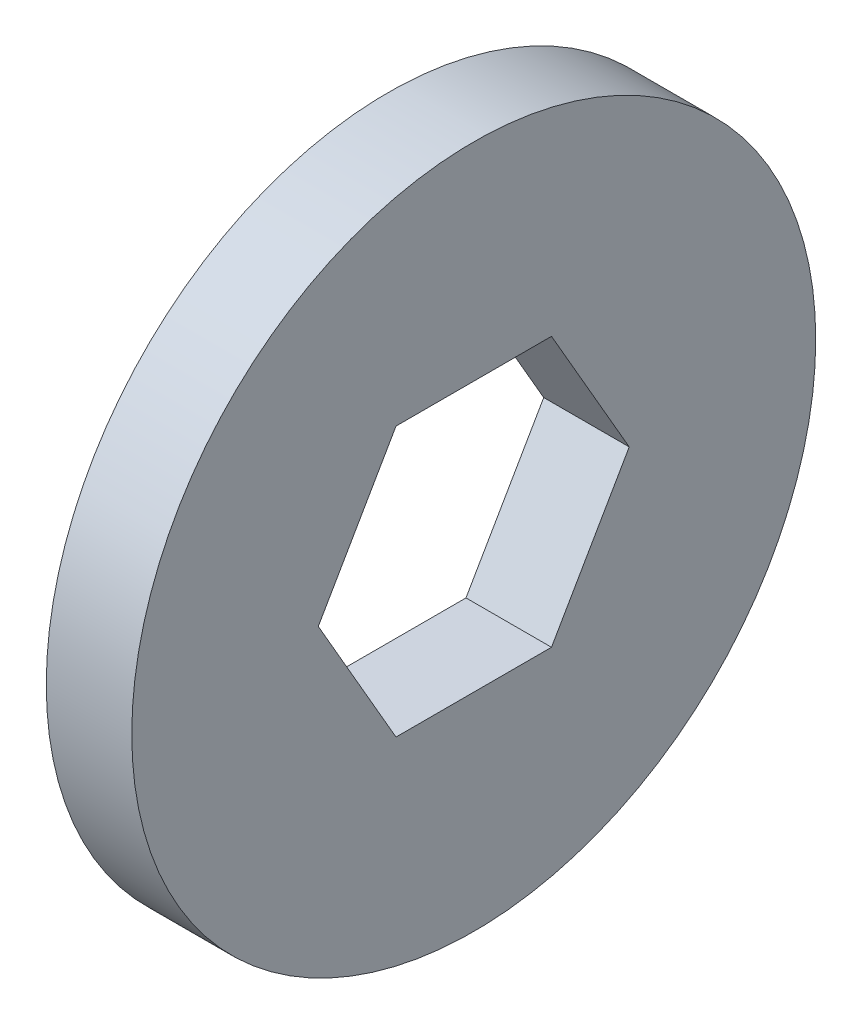
ISO-10303-21;
HEADER;
FILE_DESCRIPTION(('STEP AP214'),'2;1');
FILE_NAME('part.step','',(''),(''),'','','');
FILE_SCHEMA(('AUTOMOTIVE_DESIGN { 1 0 10303 214 1 1 1 1 }'));
ENDSEC;
DATA;
#1=APPLICATION_CONTEXT('core data for automotive mechanical design processes');
#2=APPLICATION_PROTOCOL_DEFINITION('international standard','automotive_design',2000,#1);
#3=PRODUCT_CONTEXT('',#1,'mechanical');
#4=PRODUCT('Part','Part','',(#3));
#5=PRODUCT_RELATED_PRODUCT_CATEGORY('part','',(#4));
#6=PRODUCT_DEFINITION_FORMATION('','',#4);
#7=PRODUCT_DEFINITION_CONTEXT('part definition',#1,'design');
#8=PRODUCT_DEFINITION('design','',#6,#7);
#9=PRODUCT_DEFINITION_SHAPE('','',#8);
#10=(LENGTH_UNIT() NAMED_UNIT(*) SI_UNIT(.MILLI.,.METRE.));
#11=(NAMED_UNIT(*) PLANE_ANGLE_UNIT() SI_UNIT($,.RADIAN.));
#12=(NAMED_UNIT(*) SI_UNIT($,.STERADIAN.) SOLID_ANGLE_UNIT());
#13=UNCERTAINTY_MEASURE_WITH_UNIT(LENGTH_MEASURE(1.E-05),#10,'distance_accuracy_value','');
#14=(GEOMETRIC_REPRESENTATION_CONTEXT(3) GLOBAL_UNCERTAINTY_ASSIGNED_CONTEXT((#13)) GLOBAL_UNIT_ASSIGNED_CONTEXT((#10,
#11,#12)) REPRESENTATION_CONTEXT('',''));
#15=CARTESIAN_POINT('',(0.,0.,0.));
#16=DIRECTION('',(0.,0.,1.));
#17=DIRECTION('',(1.,0.,0.));
#18=AXIS2_PLACEMENT_3D('',#15,#16,#17);
#19=CARTESIAN_POINT('',(1.5875,0.,0.));
#20=DIRECTION('',(1.,0.,0.));
#21=DIRECTION('',(0.,0.,-1.));
#22=AXIS2_PLACEMENT_3D('',#19,#20,#21);
#23=PLANE('',#22);
#24=CARTESIAN_POINT('',(1.5875,0.,0.));
#25=DIRECTION('',(1.,0.,0.));
#26=DIRECTION('',(0.,0.,-1.));
#27=AXIS2_PLACEMENT_3D('',#24,#25,#26);
#28=CIRCLE('',#27,6.35);
#29=CARTESIAN_POINT('',(1.5875,0.,-6.35));
#30=VERTEX_POINT('',#29);
#31=EDGE_CURVE('E11',#30,#30,#28,.T.);
#32=ORIENTED_EDGE('',*,*,#31,.T.);
#33=EDGE_LOOP('',(#32));
#34=FACE_BOUND('',#33,.T.);
#35=DIRECTION('',(0.,0.866025403784438,0.5));
#36=VECTOR('',#35,1.);
#37=CARTESIAN_POINT('',(1.5875,0.,-2.88675134594813));
#38=LINE('',#37,#36);
#39=CARTESIAN_POINT('',(1.5875,0.,-2.88675134594813));
#40=VERTEX_POINT('',#39);
#41=CARTESIAN_POINT('',(1.5875,2.5,-1.44337567297406));
#42=VERTEX_POINT('',#41);
#43=EDGE_CURVE('E128',#40,#42,#38,.T.);
#44=ORIENTED_EDGE('',*,*,#43,.F.);
#45=DIRECTION('',(0.,0.866025403784439,-0.5));
#46=VECTOR('',#45,1.);
#47=CARTESIAN_POINT('',(1.5875,-2.5,-1.44337567297407));
#48=LINE('',#47,#46);
#49=CARTESIAN_POINT('',(1.5875,-2.5,-1.44337567297407));
#50=VERTEX_POINT('',#49);
#51=EDGE_CURVE('E119',#50,#40,#48,.T.);
#52=ORIENTED_EDGE('',*,*,#51,.F.);
#53=DIRECTION('',(0.,0.,-1.));
#54=VECTOR('',#53,1.);
#55=CARTESIAN_POINT('',(1.5875,-2.5,1.44337567297406));
#56=LINE('',#55,#54);
#57=CARTESIAN_POINT('',(1.5875,-2.5,1.44337567297406));
#58=VERTEX_POINT('',#57);
#59=EDGE_CURVE('E154',#58,#50,#56,.T.);
#60=ORIENTED_EDGE('',*,*,#59,.F.);
#61=DIRECTION('',(0.,-0.866025403784438,-0.5));
#62=VECTOR('',#61,1.);
#63=CARTESIAN_POINT('',(1.5875,0.,2.88675134594813));
#64=LINE('',#63,#62);
#65=CARTESIAN_POINT('',(1.5875,0.,2.88675134594813));
#66=VERTEX_POINT('',#65);
#67=EDGE_CURVE('E151',#66,#58,#64,.T.);
#68=ORIENTED_EDGE('',*,*,#67,.F.);
#69=DIRECTION('',(0.,-0.866025403784439,0.5));
#70=VECTOR('',#69,1.);
#71=CARTESIAN_POINT('',(1.5875,2.5,1.44337567297406));
#72=LINE('',#71,#70);
#73=CARTESIAN_POINT('',(1.5875,2.5,1.44337567297406));
#74=VERTEX_POINT('',#73);
#75=EDGE_CURVE('E146',#74,#66,#72,.T.);
#76=ORIENTED_EDGE('',*,*,#75,.F.);
#77=DIRECTION('',(0.,0.,1.));
#78=VECTOR('',#77,1.);
#79=CARTESIAN_POINT('',(1.5875,2.5,-1.44337567297406));
#80=LINE('',#79,#78);
#81=EDGE_CURVE('E141',#42,#74,#80,.T.);
#82=ORIENTED_EDGE('',*,*,#81,.F.);
#83=EDGE_LOOP('',(#44,#52,#60,#68,#76,#82));
#84=FACE_BOUND('',#83,.T.);
#85=ADVANCED_FACE('F53',(#34,#84),#23,.T.);
#86=CARTESIAN_POINT('',(0.,0.,0.));
#87=DIRECTION('',(1.,0.,0.));
#88=DIRECTION('',(0.,0.,-1.));
#89=AXIS2_PLACEMENT_3D('',#86,#87,#88);
#90=PLANE('',#89);
#91=CARTESIAN_POINT('',(0.,0.,0.));
#92=DIRECTION('',(1.,0.,0.));
#93=DIRECTION('',(0.,0.,-1.));
#94=AXIS2_PLACEMENT_3D('',#91,#92,#93);
#95=CIRCLE('',#94,6.35);
#96=CARTESIAN_POINT('',(0.,0.,-6.35));
#97=VERTEX_POINT('',#96);
#98=EDGE_CURVE('E57',#97,#97,#95,.T.);
#99=ORIENTED_EDGE('',*,*,#98,.F.);
#100=EDGE_LOOP('',(#99));
#101=FACE_BOUND('',#100,.T.);
#102=DIRECTION('',(0.,0.866025403784439,-0.5));
#103=VECTOR('',#102,1.);
#104=CARTESIAN_POINT('',(0.,-2.5,-1.44337567297407));
#105=LINE('',#104,#103);
#106=CARTESIAN_POINT('',(0.,-2.5,-1.44337567297407));
#107=VERTEX_POINT('',#106);
#108=CARTESIAN_POINT('',(0.,0.,-2.88675134594813));
#109=VERTEX_POINT('',#108);
#110=EDGE_CURVE('E81',#107,#109,#105,.T.);
#111=ORIENTED_EDGE('',*,*,#110,.T.);
#112=DIRECTION('',(0.,0.866025403784438,0.5));
#113=VECTOR('',#112,1.);
#114=CARTESIAN_POINT('',(0.,0.,-2.88675134594813));
#115=LINE('',#114,#113);
#116=CARTESIAN_POINT('',(0.,2.5,-1.44337567297406));
#117=VERTEX_POINT('',#116);
#118=EDGE_CURVE('E135',#109,#117,#115,.T.);
#119=ORIENTED_EDGE('',*,*,#118,.T.);
#120=DIRECTION('',(0.,0.,1.));
#121=VECTOR('',#120,1.);
#122=CARTESIAN_POINT('',(0.,2.5,-1.44337567297406));
#123=LINE('',#122,#121);
#124=CARTESIAN_POINT('',(0.,2.5,1.44337567297406));
#125=VERTEX_POINT('',#124);
#126=EDGE_CURVE('E161',#117,#125,#123,.T.);
#127=ORIENTED_EDGE('',*,*,#126,.T.);
#128=DIRECTION('',(0.,-0.866025403784439,0.5));
#129=VECTOR('',#128,1.);
#130=CARTESIAN_POINT('',(0.,2.5,1.44337567297406));
#131=LINE('',#130,#129);
#132=CARTESIAN_POINT('',(0.,0.,2.88675134594813));
#133=VERTEX_POINT('',#132);
#134=EDGE_CURVE('E165',#125,#133,#131,.T.);
#135=ORIENTED_EDGE('',*,*,#134,.T.);
#136=DIRECTION('',(0.,-0.866025403784438,-0.5));
#137=VECTOR('',#136,1.);
#138=CARTESIAN_POINT('',(0.,0.,2.88675134594813));
#139=LINE('',#138,#137);
#140=CARTESIAN_POINT('',(0.,-2.5,1.44337567297406));
#141=VERTEX_POINT('',#140);
#142=EDGE_CURVE('E169',#133,#141,#139,.T.);
#143=ORIENTED_EDGE('',*,*,#142,.T.);
#144=DIRECTION('',(0.,0.,-1.));
#145=VECTOR('',#144,1.);
#146=CARTESIAN_POINT('',(0.,-2.5,1.44337567297406));
#147=LINE('',#146,#145);
#148=EDGE_CURVE('E129',#141,#107,#147,.T.);
#149=ORIENTED_EDGE('',*,*,#148,.T.);
#150=EDGE_LOOP('',(#111,#119,#127,#135,#143,#149));
#151=FACE_BOUND('',#150,.T.);
#152=ADVANCED_FACE('F194',(#101,#151),#90,.F.);
#153=CARTESIAN_POINT('',(1.5875,0.,0.));
#154=DIRECTION('',(-1.,0.,0.));
#155=DIRECTION('',(0.,0.,1.));
#156=AXIS2_PLACEMENT_3D('',#153,#154,#155);
#157=CYLINDRICAL_SURFACE('',#156,6.35);
#158=ORIENTED_EDGE('',*,*,#31,.F.);
#159=EDGE_LOOP('',(#158));
#160=FACE_BOUND('',#159,.T.);
#161=ORIENTED_EDGE('',*,*,#98,.T.);
#162=EDGE_LOOP('',(#161));
#163=FACE_BOUND('',#162,.T.);
#164=ADVANCED_FACE('F55',(#160,#163),#157,.T.);
#165=CARTESIAN_POINT('',(1.5875,-2.5,-1.44337567297407));
#166=DIRECTION('',(0.,0.5,0.866025403784439));
#167=DIRECTION('',(0.,-0.866025403784439,0.5));
#168=AXIS2_PLACEMENT_3D('',#165,#166,#167);
#169=PLANE('',#168);
#170=ORIENTED_EDGE('',*,*,#110,.F.);
#171=DIRECTION('',(-1.,0.,0.));
#172=VECTOR('',#171,1.);
#173=CARTESIAN_POINT('',(1.5875,-2.5,-1.44337567297407));
#174=LINE('',#173,#172);
#175=EDGE_CURVE('E123',#50,#107,#174,.T.);
#176=ORIENTED_EDGE('',*,*,#175,.F.);
#177=ORIENTED_EDGE('',*,*,#51,.T.);
#178=DIRECTION('',(-1.,0.,0.));
#179=VECTOR('',#178,1.);
#180=CARTESIAN_POINT('',(1.5875,0.,-2.88675134594813));
#181=LINE('',#180,#179);
#182=EDGE_CURVE('E122',#40,#109,#181,.T.);
#183=ORIENTED_EDGE('',*,*,#182,.T.);
#184=EDGE_LOOP('',(#170,#176,#177,#183));
#185=FACE_BOUND('',#184,.T.);
#186=ADVANCED_FACE('F121',(#185),#169,.T.);
#187=CARTESIAN_POINT('',(1.5875,0.,-2.88675134594813));
#188=DIRECTION('',(0.,-0.5,0.866025403784439));
#189=DIRECTION('',(0.,-0.866025403784439,-0.5));
#190=AXIS2_PLACEMENT_3D('',#187,#188,#189);
#191=PLANE('',#190);
#192=ORIENTED_EDGE('',*,*,#118,.F.);
#193=ORIENTED_EDGE('',*,*,#182,.F.);
#194=ORIENTED_EDGE('',*,*,#43,.T.);
#195=DIRECTION('',(-1.,0.,0.));
#196=VECTOR('',#195,1.);
#197=CARTESIAN_POINT('',(1.5875,2.5,-1.44337567297406));
#198=LINE('',#197,#196);
#199=EDGE_CURVE('E137',#42,#117,#198,.T.);
#200=ORIENTED_EDGE('',*,*,#199,.T.);
#201=EDGE_LOOP('',(#192,#193,#194,#200));
#202=FACE_BOUND('',#201,.T.);
#203=ADVANCED_FACE('F132',(#202),#191,.T.);
#204=CARTESIAN_POINT('',(1.5875,2.5,-1.44337567297406));
#205=DIRECTION('',(0.,-1.,0.));
#206=DIRECTION('',(0.,0.,-1.));
#207=AXIS2_PLACEMENT_3D('',#204,#205,#206);
#208=PLANE('',#207);
#209=ORIENTED_EDGE('',*,*,#126,.F.);
#210=ORIENTED_EDGE('',*,*,#199,.F.);
#211=ORIENTED_EDGE('',*,*,#81,.T.);
#212=DIRECTION('',(-1.,0.,0.));
#213=VECTOR('',#212,1.);
#214=CARTESIAN_POINT('',(1.5875,2.5,1.44337567297406));
#215=LINE('',#214,#213);
#216=EDGE_CURVE('E183',#74,#125,#215,.T.);
#217=ORIENTED_EDGE('',*,*,#216,.T.);
#218=EDGE_LOOP('',(#209,#210,#211,#217));
#219=FACE_BOUND('',#218,.T.);
#220=ADVANCED_FACE('F190',(#219),#208,.T.);
#221=CARTESIAN_POINT('',(1.5875,2.5,1.44337567297406));
#222=DIRECTION('',(0.,-0.5,-0.866025403784439));
#223=DIRECTION('',(0.,0.866025403784439,-0.5));
#224=AXIS2_PLACEMENT_3D('',#221,#222,#223);
#225=PLANE('',#224);
#226=ORIENTED_EDGE('',*,*,#134,.F.);
#227=ORIENTED_EDGE('',*,*,#216,.F.);
#228=ORIENTED_EDGE('',*,*,#75,.T.);
#229=DIRECTION('',(-1.,0.,0.));
#230=VECTOR('',#229,1.);
#231=CARTESIAN_POINT('',(1.5875,0.,2.88675134594813));
#232=LINE('',#231,#230);
#233=EDGE_CURVE('E180',#66,#133,#232,.T.);
#234=ORIENTED_EDGE('',*,*,#233,.T.);
#235=EDGE_LOOP('',(#226,#227,#228,#234));
#236=FACE_BOUND('',#235,.T.);
#237=ADVANCED_FACE('F202',(#236),#225,.T.);
#238=CARTESIAN_POINT('',(1.5875,0.,2.88675134594813));
#239=DIRECTION('',(0.,0.5,-0.866025403784438));
#240=DIRECTION('',(0.,0.866025403784439,0.5));
#241=AXIS2_PLACEMENT_3D('',#238,#239,#240);
#242=PLANE('',#241);
#243=ORIENTED_EDGE('',*,*,#142,.F.);
#244=ORIENTED_EDGE('',*,*,#233,.F.);
#245=ORIENTED_EDGE('',*,*,#67,.T.);
#246=DIRECTION('',(-1.,0.,0.));
#247=VECTOR('',#246,1.);
#248=CARTESIAN_POINT('',(1.5875,-2.5,1.44337567297406));
#249=LINE('',#248,#247);
#250=EDGE_CURVE('E72',#58,#141,#249,.T.);
#251=ORIENTED_EDGE('',*,*,#250,.T.);
#252=EDGE_LOOP('',(#243,#244,#245,#251));
#253=FACE_BOUND('',#252,.T.);
#254=ADVANCED_FACE('F200',(#253),#242,.T.);
#255=CARTESIAN_POINT('',(1.5875,-2.5,1.44337567297406));
#256=DIRECTION('',(0.,1.,0.));
#257=DIRECTION('',(0.,0.,1.));
#258=AXIS2_PLACEMENT_3D('',#255,#256,#257);
#259=PLANE('',#258);
#260=ORIENTED_EDGE('',*,*,#148,.F.);
#261=ORIENTED_EDGE('',*,*,#250,.F.);
#262=ORIENTED_EDGE('',*,*,#59,.T.);
#263=ORIENTED_EDGE('',*,*,#175,.T.);
#264=EDGE_LOOP('',(#260,#261,#262,#263));
#265=FACE_BOUND('',#264,.T.);
#266=ADVANCED_FACE('F196',(#265),#259,.T.);
#267=CLOSED_SHELL('',(#85,#152,#164,#186,#203,#220,#237,#254,#266));
#268=MANIFOLD_SOLID_BREP('B2',#267);
#269=ADVANCED_BREP_SHAPE_REPRESENTATION('',(#18,#268),#14);
#270=SHAPE_DEFINITION_REPRESENTATION(#9,#269);
ENDSEC;
END-ISO-10303-21;
